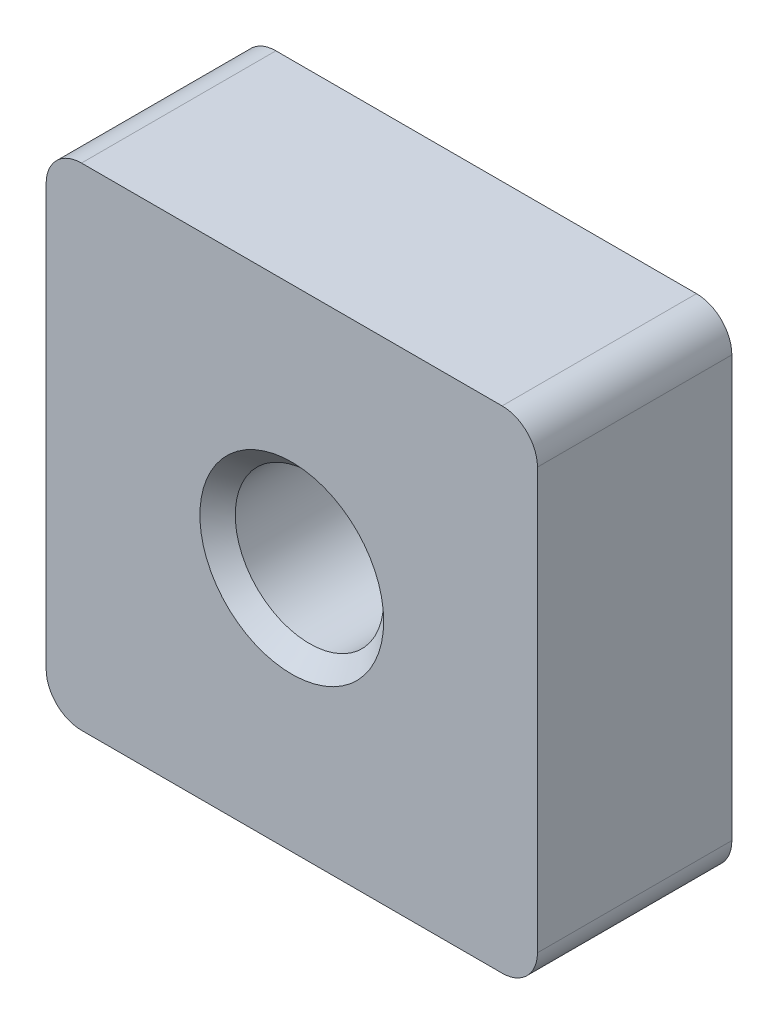
ISO-10303-21;
HEADER;
FILE_DESCRIPTION(('STEP AP214'),'2;1');
FILE_NAME('part.step','',(''),(''),'','','');
FILE_SCHEMA(('AUTOMOTIVE_DESIGN { 1 0 10303 214 1 1 1 1 }'));
ENDSEC;
DATA;
#1=APPLICATION_CONTEXT('core data for automotive mechanical design processes');
#2=APPLICATION_PROTOCOL_DEFINITION('international standard','automotive_design',2000,#1);
#3=PRODUCT_CONTEXT('',#1,'mechanical');
#4=PRODUCT('Part','Part','',(#3));
#5=PRODUCT_RELATED_PRODUCT_CATEGORY('part','',(#4));
#6=PRODUCT_DEFINITION_FORMATION('','',#4);
#7=PRODUCT_DEFINITION_CONTEXT('part definition',#1,'design');
#8=PRODUCT_DEFINITION('design','',#6,#7);
#9=PRODUCT_DEFINITION_SHAPE('','',#8);
#10=(LENGTH_UNIT() NAMED_UNIT(*) SI_UNIT(.MILLI.,.METRE.));
#11=(NAMED_UNIT(*) PLANE_ANGLE_UNIT() SI_UNIT($,.RADIAN.));
#12=(NAMED_UNIT(*) SI_UNIT($,.STERADIAN.) SOLID_ANGLE_UNIT());
#13=UNCERTAINTY_MEASURE_WITH_UNIT(LENGTH_MEASURE(1.E-05),#10,'distance_accuracy_value','');
#14=(GEOMETRIC_REPRESENTATION_CONTEXT(3) GLOBAL_UNCERTAINTY_ASSIGNED_CONTEXT((#13)) GLOBAL_UNIT_ASSIGNED_CONTEXT((#10,
#11,#12)) REPRESENTATION_CONTEXT('',''));
#15=CARTESIAN_POINT('',(0.,0.,0.));
#16=DIRECTION('',(0.,0.,1.));
#17=DIRECTION('',(1.,0.,0.));
#18=AXIS2_PLACEMENT_3D('',#15,#16,#17);
#19=CARTESIAN_POINT('',(6.95,-6.95,5.5));
#20=DIRECTION('',(-1.,0.,0.));
#21=DIRECTION('',(0.,0.,1.));
#22=AXIS2_PLACEMENT_3D('',#19,#20,#21);
#23=PLANE('',#22);
#24=DIRECTION('',(0.,1.,0.));
#25=VECTOR('',#24,1.);
#26=CARTESIAN_POINT('',(6.95,-6.95,0.));
#27=LINE('',#26,#25);
#28=CARTESIAN_POINT('',(6.95,-5.95,0.));
#29=VERTEX_POINT('',#28);
#30=CARTESIAN_POINT('',(6.95,5.95,0.));
#31=VERTEX_POINT('',#30);
#32=EDGE_CURVE('E129',#29,#31,#27,.T.);
#33=ORIENTED_EDGE('',*,*,#32,.T.);
#34=DIRECTION('',(0.,0.,-1.));
#35=VECTOR('',#34,1.);
#36=CARTESIAN_POINT('',(6.95,5.95,5.5));
#37=LINE('',#36,#35);
#38=CARTESIAN_POINT('',(6.95,5.95,5.5));
#39=VERTEX_POINT('',#38);
#40=EDGE_CURVE('E107',#31,#39,#37,.F.);
#41=ORIENTED_EDGE('',*,*,#40,.T.);
#42=DIRECTION('',(0.,1.,0.));
#43=VECTOR('',#42,1.);
#44=CARTESIAN_POINT('',(6.95,-6.95,5.5));
#45=LINE('',#44,#43);
#46=CARTESIAN_POINT('',(6.95,-5.95,5.5));
#47=VERTEX_POINT('',#46);
#48=EDGE_CURVE('E139',#47,#39,#45,.T.);
#49=ORIENTED_EDGE('',*,*,#48,.F.);
#50=DIRECTION('',(0.,0.,-1.));
#51=VECTOR('',#50,1.);
#52=CARTESIAN_POINT('',(6.95,-5.95,5.5));
#53=LINE('',#52,#51);
#54=EDGE_CURVE('E112',#47,#29,#53,.T.);
#55=ORIENTED_EDGE('',*,*,#54,.T.);
#56=EDGE_LOOP('',(#33,#41,#49,#55));
#57=FACE_BOUND('',#56,.T.);
#58=ADVANCED_FACE('F37',(#57),#23,.F.);
#59=CARTESIAN_POINT('',(-6.95,6.95,5.5));
#60=DIRECTION('',(0.,-1.,0.));
#61=DIRECTION('',(0.,0.,-1.));
#62=AXIS2_PLACEMENT_3D('',#59,#60,#61);
#63=PLANE('',#62);
#64=DIRECTION('',(-1.,0.,0.));
#65=VECTOR('',#64,1.);
#66=CARTESIAN_POINT('',(-6.95,6.95,5.5));
#67=LINE('',#66,#65);
#68=CARTESIAN_POINT('',(5.95,6.95,5.5));
#69=VERTEX_POINT('',#68);
#70=CARTESIAN_POINT('',(-5.95,6.95,5.5));
#71=VERTEX_POINT('',#70);
#72=EDGE_CURVE('E122',#69,#71,#67,.T.);
#73=ORIENTED_EDGE('',*,*,#72,.F.);
#74=DIRECTION('',(0.,0.,-1.));
#75=VECTOR('',#74,1.);
#76=CARTESIAN_POINT('',(5.95,6.95,5.5));
#77=LINE('',#76,#75);
#78=CARTESIAN_POINT('',(5.95,6.95,0.));
#79=VERTEX_POINT('',#78);
#80=EDGE_CURVE('E106',#69,#79,#77,.T.);
#81=ORIENTED_EDGE('',*,*,#80,.T.);
#82=DIRECTION('',(-1.,0.,0.));
#83=VECTOR('',#82,1.);
#84=CARTESIAN_POINT('',(-6.95,6.95,0.));
#85=LINE('',#84,#83);
#86=CARTESIAN_POINT('',(-5.95,6.95,0.));
#87=VERTEX_POINT('',#86);
#88=EDGE_CURVE('E119',#79,#87,#85,.T.);
#89=ORIENTED_EDGE('',*,*,#88,.T.);
#90=DIRECTION('',(0.,0.,-1.));
#91=VECTOR('',#90,1.);
#92=CARTESIAN_POINT('',(-5.95,6.95,5.5));
#93=LINE('',#92,#91);
#94=EDGE_CURVE('E124',#87,#71,#93,.F.);
#95=ORIENTED_EDGE('',*,*,#94,.T.);
#96=EDGE_LOOP('',(#73,#81,#89,#95));
#97=FACE_BOUND('',#96,.T.);
#98=ADVANCED_FACE('F118',(#97),#63,.F.);
#99=CARTESIAN_POINT('',(-6.95,-6.95,5.5));
#100=DIRECTION('',(1.,0.,0.));
#101=DIRECTION('',(0.,0.,-1.));
#102=AXIS2_PLACEMENT_3D('',#99,#100,#101);
#103=PLANE('',#102);
#104=DIRECTION('',(0.,-1.,0.));
#105=VECTOR('',#104,1.);
#106=CARTESIAN_POINT('',(-6.95,-6.95,5.5));
#107=LINE('',#106,#105);
#108=CARTESIAN_POINT('',(-6.95,5.95,5.5));
#109=VERTEX_POINT('',#108);
#110=CARTESIAN_POINT('',(-6.95,-5.95,5.5));
#111=VERTEX_POINT('',#110);
#112=EDGE_CURVE('E173',#109,#111,#107,.T.);
#113=ORIENTED_EDGE('',*,*,#112,.F.);
#114=DIRECTION('',(0.,0.,-1.));
#115=VECTOR('',#114,1.);
#116=CARTESIAN_POINT('',(-6.95,5.95,5.5));
#117=LINE('',#116,#115);
#118=CARTESIAN_POINT('',(-6.95,5.95,0.));
#119=VERTEX_POINT('',#118);
#120=EDGE_CURVE('E158',#109,#119,#117,.T.);
#121=ORIENTED_EDGE('',*,*,#120,.T.);
#122=DIRECTION('',(0.,-1.,0.));
#123=VECTOR('',#122,1.);
#124=CARTESIAN_POINT('',(-6.95,-6.95,0.));
#125=LINE('',#124,#123);
#126=CARTESIAN_POINT('',(-6.95,-5.95,0.));
#127=VERTEX_POINT('',#126);
#128=EDGE_CURVE('E128',#119,#127,#125,.T.);
#129=ORIENTED_EDGE('',*,*,#128,.T.);
#130=DIRECTION('',(0.,0.,-1.));
#131=VECTOR('',#130,1.);
#132=CARTESIAN_POINT('',(-6.95,-5.95,5.5));
#133=LINE('',#132,#131);
#134=EDGE_CURVE('E156',#127,#111,#133,.F.);
#135=ORIENTED_EDGE('',*,*,#134,.T.);
#136=EDGE_LOOP('',(#113,#121,#129,#135));
#137=FACE_BOUND('',#136,.T.);
#138=ADVANCED_FACE('F189',(#137),#103,.F.);
#139=CARTESIAN_POINT('',(-6.95,-6.95,5.5));
#140=DIRECTION('',(0.,1.,0.));
#141=DIRECTION('',(0.,0.,1.));
#142=AXIS2_PLACEMENT_3D('',#139,#140,#141);
#143=PLANE('',#142);
#144=DIRECTION('',(1.,0.,0.));
#145=VECTOR('',#144,1.);
#146=CARTESIAN_POINT('',(-6.95,-6.95,0.));
#147=LINE('',#146,#145);
#148=CARTESIAN_POINT('',(-5.95,-6.95,0.));
#149=VERTEX_POINT('',#148);
#150=CARTESIAN_POINT('',(5.95,-6.95,0.));
#151=VERTEX_POINT('',#150);
#152=EDGE_CURVE('E132',#149,#151,#147,.T.);
#153=ORIENTED_EDGE('',*,*,#152,.T.);
#154=DIRECTION('',(0.,0.,-1.));
#155=VECTOR('',#154,1.);
#156=CARTESIAN_POINT('',(5.95,-6.95,5.5));
#157=LINE('',#156,#155);
#158=CARTESIAN_POINT('',(5.95,-6.95,5.5));
#159=VERTEX_POINT('',#158);
#160=EDGE_CURVE('E11',#151,#159,#157,.F.);
#161=ORIENTED_EDGE('',*,*,#160,.T.);
#162=DIRECTION('',(1.,0.,0.));
#163=VECTOR('',#162,1.);
#164=CARTESIAN_POINT('',(-6.95,-6.95,5.5));
#165=LINE('',#164,#163);
#166=CARTESIAN_POINT('',(-5.95,-6.95,5.5));
#167=VERTEX_POINT('',#166);
#168=EDGE_CURVE('E140',#167,#159,#165,.T.);
#169=ORIENTED_EDGE('',*,*,#168,.F.);
#170=DIRECTION('',(0.,0.,-1.));
#171=VECTOR('',#170,1.);
#172=CARTESIAN_POINT('',(-5.95,-6.95,5.5));
#173=LINE('',#172,#171);
#174=EDGE_CURVE('E45',#167,#149,#173,.T.);
#175=ORIENTED_EDGE('',*,*,#174,.T.);
#176=EDGE_LOOP('',(#153,#161,#169,#175));
#177=FACE_BOUND('',#176,.T.);
#178=ADVANCED_FACE('F163',(#177),#143,.F.);
#179=CARTESIAN_POINT('',(0.,0.,5.5));
#180=DIRECTION('',(0.,0.,-1.));
#181=DIRECTION('',(-1.,0.,0.));
#182=AXIS2_PLACEMENT_3D('',#179,#180,#181);
#183=PLANE('',#182);
#184=CARTESIAN_POINT('',(0.,0.,5.5));
#185=DIRECTION('',(0.,0.,1.));
#186=DIRECTION('',(1.,0.,0.));
#187=AXIS2_PLACEMENT_3D('',#184,#185,#186);
#188=CIRCLE('',#187,2.6);
#189=CARTESIAN_POINT('',(2.6,0.,5.5));
#190=VERTEX_POINT('',#189);
#191=EDGE_CURVE('E298',#190,#190,#188,.T.);
#192=ORIENTED_EDGE('',*,*,#191,.F.);
#193=EDGE_LOOP('',(#192));
#194=FACE_BOUND('',#193,.T.);
#195=ORIENTED_EDGE('',*,*,#48,.T.);
#196=CARTESIAN_POINT('',(5.95,5.95,5.5));
#197=DIRECTION('',(0.,0.,-1.));
#198=DIRECTION('',(-1.,0.,0.));
#199=AXIS2_PLACEMENT_3D('',#196,#197,#198);
#200=CIRCLE('',#199,1.);
#201=EDGE_CURVE('E154',#39,#69,#200,.F.);
#202=ORIENTED_EDGE('',*,*,#201,.T.);
#203=ORIENTED_EDGE('',*,*,#72,.T.);
#204=CARTESIAN_POINT('',(-5.95,5.95,5.5));
#205=DIRECTION('',(0.,0.,-1.));
#206=DIRECTION('',(-1.,0.,0.));
#207=AXIS2_PLACEMENT_3D('',#204,#205,#206);
#208=CIRCLE('',#207,1.);
#209=EDGE_CURVE('E152',#71,#109,#208,.F.);
#210=ORIENTED_EDGE('',*,*,#209,.T.);
#211=ORIENTED_EDGE('',*,*,#112,.T.);
#212=CARTESIAN_POINT('',(-5.95,-5.95,5.5));
#213=DIRECTION('',(0.,0.,-1.));
#214=DIRECTION('',(-1.,0.,0.));
#215=AXIS2_PLACEMENT_3D('',#212,#213,#214);
#216=CIRCLE('',#215,1.);
#217=EDGE_CURVE('E57',#111,#167,#216,.F.);
#218=ORIENTED_EDGE('',*,*,#217,.T.);
#219=ORIENTED_EDGE('',*,*,#168,.T.);
#220=CARTESIAN_POINT('',(5.95,-5.95,5.5));
#221=DIRECTION('',(0.,0.,-1.));
#222=DIRECTION('',(-1.,0.,0.));
#223=AXIS2_PLACEMENT_3D('',#220,#221,#222);
#224=CIRCLE('',#223,1.);
#225=EDGE_CURVE('E150',#159,#47,#224,.F.);
#226=ORIENTED_EDGE('',*,*,#225,.T.);
#227=EDGE_LOOP('',(#195,#202,#203,#210,#211,#218,#219,#226));
#228=FACE_BOUND('',#227,.T.);
#229=ADVANCED_FACE('F178',(#194,#228),#183,.F.);
#230=CARTESIAN_POINT('',(0.,0.,0.));
#231=DIRECTION('',(0.,0.,-1.));
#232=DIRECTION('',(-1.,0.,0.));
#233=AXIS2_PLACEMENT_3D('',#230,#231,#232);
#234=PLANE('',#233);
#235=CARTESIAN_POINT('',(0.,0.,0.));
#236=DIRECTION('',(0.,0.,1.));
#237=DIRECTION('',(1.,0.,0.));
#238=AXIS2_PLACEMENT_3D('',#235,#236,#237);
#239=CIRCLE('',#238,2.6);
#240=CARTESIAN_POINT('',(2.6,0.,0.));
#241=VERTEX_POINT('',#240);
#242=EDGE_CURVE('E293',#241,#241,#239,.T.);
#243=ORIENTED_EDGE('',*,*,#242,.T.);
#244=EDGE_LOOP('',(#243));
#245=FACE_BOUND('',#244,.T.);
#246=ORIENTED_EDGE('',*,*,#88,.F.);
#247=CARTESIAN_POINT('',(5.95,5.95,0.));
#248=DIRECTION('',(0.,0.,-1.));
#249=DIRECTION('',(-1.,0.,0.));
#250=AXIS2_PLACEMENT_3D('',#247,#248,#249);
#251=CIRCLE('',#250,1.);
#252=EDGE_CURVE('E102',#79,#31,#251,.T.);
#253=ORIENTED_EDGE('',*,*,#252,.T.);
#254=ORIENTED_EDGE('',*,*,#32,.F.);
#255=CARTESIAN_POINT('',(5.95,-5.95,0.));
#256=DIRECTION('',(0.,0.,-1.));
#257=DIRECTION('',(-1.,0.,0.));
#258=AXIS2_PLACEMENT_3D('',#255,#256,#257);
#259=CIRCLE('',#258,1.);
#260=EDGE_CURVE('E143',#29,#151,#259,.T.);
#261=ORIENTED_EDGE('',*,*,#260,.T.);
#262=ORIENTED_EDGE('',*,*,#152,.F.);
#263=CARTESIAN_POINT('',(-5.95,-5.95,0.));
#264=DIRECTION('',(0.,0.,-1.));
#265=DIRECTION('',(-1.,0.,0.));
#266=AXIS2_PLACEMENT_3D('',#263,#264,#265);
#267=CIRCLE('',#266,1.);
#268=EDGE_CURVE('E123',#149,#127,#267,.T.);
#269=ORIENTED_EDGE('',*,*,#268,.T.);
#270=ORIENTED_EDGE('',*,*,#128,.F.);
#271=CARTESIAN_POINT('',(-5.95,5.95,0.));
#272=DIRECTION('',(0.,0.,-1.));
#273=DIRECTION('',(-1.,0.,0.));
#274=AXIS2_PLACEMENT_3D('',#271,#272,#273);
#275=CIRCLE('',#274,1.);
#276=EDGE_CURVE('E113',#119,#87,#275,.T.);
#277=ORIENTED_EDGE('',*,*,#276,.T.);
#278=EDGE_LOOP('',(#246,#253,#254,#261,#262,#269,#270,#277));
#279=FACE_BOUND('',#278,.T.);
#280=ADVANCED_FACE('F126',(#245,#279),#234,.T.);
#281=CARTESIAN_POINT('',(0.,0.,0.500000000000002));
#282=DIRECTION('',(0.,0.,-1.));
#283=DIRECTION('',(-1.,0.,0.));
#284=AXIS2_PLACEMENT_3D('',#281,#282,#283);
#285=CONICAL_SURFACE('',#284,2.1,0.785398163397447);
#286=ORIENTED_EDGE('',*,*,#242,.F.);
#287=EDGE_LOOP('',(#286));
#288=FACE_BOUND('',#287,.T.);
#289=CARTESIAN_POINT('',(0.,0.,0.500000000000002));
#290=DIRECTION('',(0.,0.,1.));
#291=DIRECTION('',(1.,0.,0.));
#292=AXIS2_PLACEMENT_3D('',#289,#290,#291);
#293=CIRCLE('',#292,2.1);
#294=CARTESIAN_POINT('',(2.1,0.,0.500000000000002));
#295=VERTEX_POINT('',#294);
#296=EDGE_CURVE('E134',#295,#295,#293,.T.);
#297=ORIENTED_EDGE('',*,*,#296,.T.);
#298=EDGE_LOOP('',(#297));
#299=FACE_BOUND('',#298,.T.);
#300=ADVANCED_FACE('F186',(#288,#299),#285,.F.);
#301=CARTESIAN_POINT('',(0.,0.,5.5));
#302=DIRECTION('',(0.,0.,1.));
#303=DIRECTION('',(1.,0.,0.));
#304=AXIS2_PLACEMENT_3D('',#301,#302,#303);
#305=CYLINDRICAL_SURFACE('',#304,2.1);
#306=ORIENTED_EDGE('',*,*,#296,.F.);
#307=EDGE_LOOP('',(#306));
#308=FACE_BOUND('',#307,.T.);
#309=CARTESIAN_POINT('',(0.,0.,5.));
#310=DIRECTION('',(0.,0.,1.));
#311=DIRECTION('',(1.,0.,0.));
#312=AXIS2_PLACEMENT_3D('',#309,#310,#311);
#313=CIRCLE('',#312,2.1);
#314=CARTESIAN_POINT('',(2.1,0.,5.));
#315=VERTEX_POINT('',#314);
#316=EDGE_CURVE('E296',#315,#315,#313,.T.);
#317=ORIENTED_EDGE('',*,*,#316,.T.);
#318=EDGE_LOOP('',(#317));
#319=FACE_BOUND('',#318,.T.);
#320=ADVANCED_FACE('F268',(#308,#319),#305,.F.);
#321=CARTESIAN_POINT('',(0.,0.,5.5));
#322=DIRECTION('',(0.,0.,1.));
#323=DIRECTION('',(1.,0.,0.));
#324=AXIS2_PLACEMENT_3D('',#321,#322,#323);
#325=CONICAL_SURFACE('',#324,2.6,0.785398163397448);
#326=ORIENTED_EDGE('',*,*,#316,.F.);
#327=EDGE_LOOP('',(#326));
#328=FACE_BOUND('',#327,.T.);
#329=ORIENTED_EDGE('',*,*,#191,.T.);
#330=EDGE_LOOP('',(#329));
#331=FACE_BOUND('',#330,.T.);
#332=ADVANCED_FACE('F204',(#328,#331),#325,.F.);
#333=CARTESIAN_POINT('',(5.95,5.95,5.5));
#334=DIRECTION('',(0.,0.,-1.));
#335=DIRECTION('',(-1.,0.,0.));
#336=AXIS2_PLACEMENT_3D('',#333,#334,#335);
#337=CYLINDRICAL_SURFACE('',#336,1.);
#338=ORIENTED_EDGE('',*,*,#201,.F.);
#339=ORIENTED_EDGE('',*,*,#40,.F.);
#340=ORIENTED_EDGE('',*,*,#252,.F.);
#341=ORIENTED_EDGE('',*,*,#80,.F.);
#342=EDGE_LOOP('',(#338,#339,#340,#341));
#343=FACE_BOUND('',#342,.T.);
#344=ADVANCED_FACE('F105',(#343),#337,.T.);
#345=CARTESIAN_POINT('',(-5.95,5.95,5.5));
#346=DIRECTION('',(0.,0.,-1.));
#347=DIRECTION('',(-1.,0.,0.));
#348=AXIS2_PLACEMENT_3D('',#345,#346,#347);
#349=CYLINDRICAL_SURFACE('',#348,1.);
#350=ORIENTED_EDGE('',*,*,#209,.F.);
#351=ORIENTED_EDGE('',*,*,#94,.F.);
#352=ORIENTED_EDGE('',*,*,#276,.F.);
#353=ORIENTED_EDGE('',*,*,#120,.F.);
#354=EDGE_LOOP('',(#350,#351,#352,#353));
#355=FACE_BOUND('',#354,.T.);
#356=ADVANCED_FACE('F203',(#355),#349,.T.);
#357=CARTESIAN_POINT('',(5.95,-5.95,5.5));
#358=DIRECTION('',(0.,0.,-1.));
#359=DIRECTION('',(-1.,0.,0.));
#360=AXIS2_PLACEMENT_3D('',#357,#358,#359);
#361=CYLINDRICAL_SURFACE('',#360,1.);
#362=ORIENTED_EDGE('',*,*,#225,.F.);
#363=ORIENTED_EDGE('',*,*,#160,.F.);
#364=ORIENTED_EDGE('',*,*,#260,.F.);
#365=ORIENTED_EDGE('',*,*,#54,.F.);
#366=EDGE_LOOP('',(#362,#363,#364,#365));
#367=FACE_BOUND('',#366,.T.);
#368=ADVANCED_FACE('F168',(#367),#361,.T.);
#369=CARTESIAN_POINT('',(-5.95,-5.95,5.5));
#370=DIRECTION('',(0.,0.,-1.));
#371=DIRECTION('',(-1.,0.,0.));
#372=AXIS2_PLACEMENT_3D('',#369,#370,#371);
#373=CYLINDRICAL_SURFACE('',#372,1.);
#374=ORIENTED_EDGE('',*,*,#217,.F.);
#375=ORIENTED_EDGE('',*,*,#134,.F.);
#376=ORIENTED_EDGE('',*,*,#268,.F.);
#377=ORIENTED_EDGE('',*,*,#174,.F.);
#378=EDGE_LOOP('',(#374,#375,#376,#377));
#379=FACE_BOUND('',#378,.T.);
#380=ADVANCED_FACE('F39',(#379),#373,.T.);
#381=CLOSED_SHELL('',(#58,#98,#138,#178,#229,#280,#300,#320,#332,#344,#356,#368,#380));
#382=MANIFOLD_SOLID_BREP('B2',#381);
#383=ADVANCED_BREP_SHAPE_REPRESENTATION('',(#18,#382),#14);
#384=SHAPE_DEFINITION_REPRESENTATION(#9,#383);
ENDSEC;
END-ISO-10303-21;
